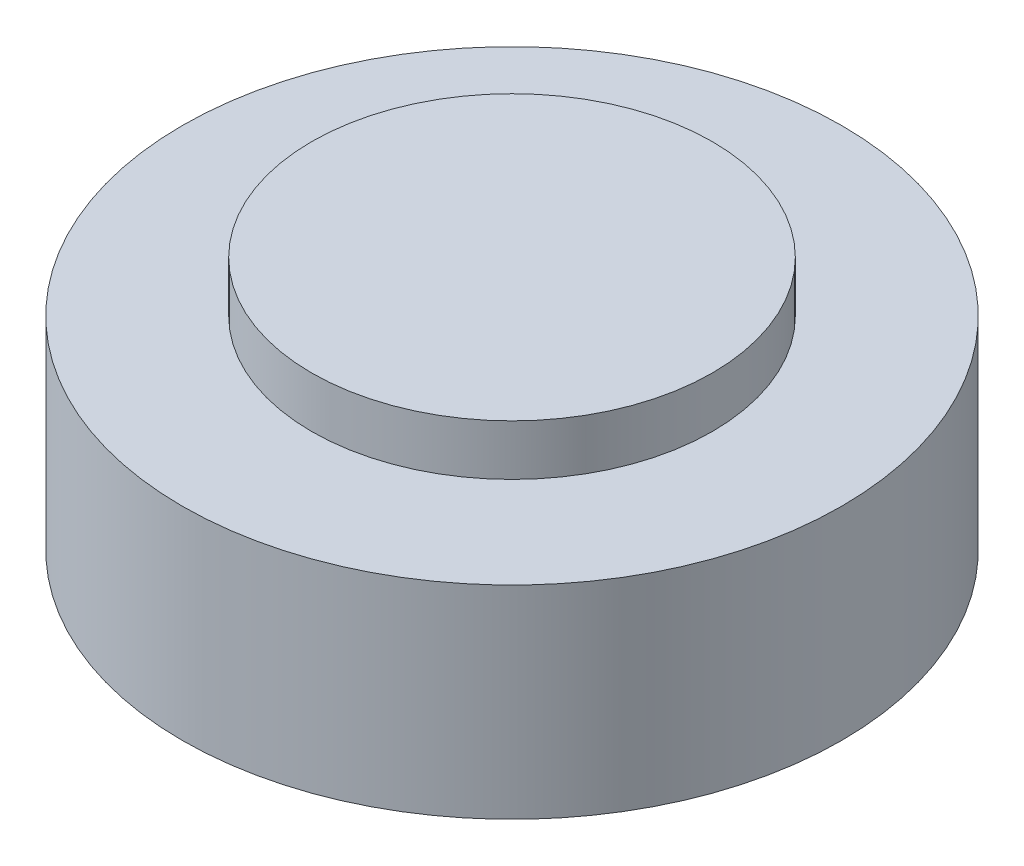
ISO-10303-21;
HEADER;
FILE_DESCRIPTION(('STEP AP214'),'2;1');
FILE_NAME('part.step','',(''),(''),'','','');
FILE_SCHEMA(('AUTOMOTIVE_DESIGN { 1 0 10303 214 1 1 1 1 }'));
ENDSEC;
DATA;
#1=APPLICATION_CONTEXT('core data for automotive mechanical design processes');
#2=APPLICATION_PROTOCOL_DEFINITION('international standard','automotive_design',2000,#1);
#3=PRODUCT_CONTEXT('',#1,'mechanical');
#4=PRODUCT('Part','Part','',(#3));
#5=PRODUCT_RELATED_PRODUCT_CATEGORY('part','',(#4));
#6=PRODUCT_DEFINITION_FORMATION('','',#4);
#7=PRODUCT_DEFINITION_CONTEXT('part definition',#1,'design');
#8=PRODUCT_DEFINITION('design','',#6,#7);
#9=PRODUCT_DEFINITION_SHAPE('','',#8);
#10=(LENGTH_UNIT() NAMED_UNIT(*) SI_UNIT(.MILLI.,.METRE.));
#11=(NAMED_UNIT(*) PLANE_ANGLE_UNIT() SI_UNIT($,.RADIAN.));
#12=(NAMED_UNIT(*) SI_UNIT($,.STERADIAN.) SOLID_ANGLE_UNIT());
#13=UNCERTAINTY_MEASURE_WITH_UNIT(LENGTH_MEASURE(1.E-05),#10,'distance_accuracy_value','');
#14=(GEOMETRIC_REPRESENTATION_CONTEXT(3) GLOBAL_UNCERTAINTY_ASSIGNED_CONTEXT((#13)) GLOBAL_UNIT_ASSIGNED_CONTEXT((#10,
#11,#12)) REPRESENTATION_CONTEXT('',''));
#15=CARTESIAN_POINT('',(0.,0.,0.));
#16=DIRECTION('',(0.,0.,1.));
#17=DIRECTION('',(1.,0.,0.));
#18=AXIS2_PLACEMENT_3D('',#15,#16,#17);
#19=CARTESIAN_POINT('',(0.,2.,0.));
#20=DIRECTION('',(0.,-1.,0.));
#21=DIRECTION('',(0.,0.,-1.));
#22=AXIS2_PLACEMENT_3D('',#19,#20,#21);
#23=CYLINDRICAL_SURFACE('',#22,7.9);
#24=CARTESIAN_POINT('',(0.,2.,0.));
#25=DIRECTION('',(0.,1.,0.));
#26=DIRECTION('',(0.,0.,1.));
#27=AXIS2_PLACEMENT_3D('',#24,#25,#26);
#28=CIRCLE('',#27,7.9);
#29=CARTESIAN_POINT('',(0.,2.,7.9));
#30=VERTEX_POINT('',#29);
#31=EDGE_CURVE('E10',#30,#30,#28,.T.);
#32=ORIENTED_EDGE('',*,*,#31,.F.);
#33=EDGE_LOOP('',(#32));
#34=FACE_BOUND('',#33,.T.);
#35=CARTESIAN_POINT('',(0.,0.,0.));
#36=DIRECTION('',(0.,1.,0.));
#37=DIRECTION('',(0.,0.,1.));
#38=AXIS2_PLACEMENT_3D('',#35,#36,#37);
#39=CIRCLE('',#38,7.9);
#40=CARTESIAN_POINT('',(0.,0.,7.9));
#41=VERTEX_POINT('',#40);
#42=EDGE_CURVE('E40',#41,#41,#39,.T.);
#43=ORIENTED_EDGE('',*,*,#42,.T.);
#44=EDGE_LOOP('',(#43));
#45=FACE_BOUND('',#44,.T.);
#46=ADVANCED_FACE('F37',(#34,#45),#23,.T.);
#47=CARTESIAN_POINT('',(0.,2.,0.));
#48=DIRECTION('',(0.,1.,0.));
#49=DIRECTION('',(0.,0.,1.));
#50=AXIS2_PLACEMENT_3D('',#47,#48,#49);
#51=PLANE('',#50);
#52=ORIENTED_EDGE('',*,*,#31,.T.);
#53=EDGE_LOOP('',(#52));
#54=FACE_BOUND('',#53,.T.);
#55=ADVANCED_FACE('F68',(#54),#51,.T.);
#56=CARTESIAN_POINT('',(0.,-8.,0.));
#57=DIRECTION('',(0.,1.,0.));
#58=DIRECTION('',(0.,0.,1.));
#59=AXIS2_PLACEMENT_3D('',#56,#57,#58);
#60=CYLINDRICAL_SURFACE('',#59,13.);
#61=CARTESIAN_POINT('',(0.,-8.,0.));
#62=DIRECTION('',(0.,1.,0.));
#63=DIRECTION('',(0.,0.,1.));
#64=AXIS2_PLACEMENT_3D('',#61,#62,#63);
#65=CIRCLE('',#64,13.);
#66=CARTESIAN_POINT('',(0.,-8.,13.));
#67=VERTEX_POINT('',#66);
#68=EDGE_CURVE('E47',#67,#67,#65,.T.);
#69=ORIENTED_EDGE('',*,*,#68,.T.);
#70=EDGE_LOOP('',(#69));
#71=FACE_BOUND('',#70,.T.);
#72=CARTESIAN_POINT('',(0.,0.,0.));
#73=DIRECTION('',(0.,1.,0.));
#74=DIRECTION('',(0.,0.,1.));
#75=AXIS2_PLACEMENT_3D('',#72,#73,#74);
#76=CIRCLE('',#75,13.);
#77=CARTESIAN_POINT('',(0.,0.,13.));
#78=VERTEX_POINT('',#77);
#79=EDGE_CURVE('E49',#78,#78,#76,.T.);
#80=ORIENTED_EDGE('',*,*,#79,.F.);
#81=EDGE_LOOP('',(#80));
#82=FACE_BOUND('',#81,.T.);
#83=ADVANCED_FACE('F55',(#71,#82),#60,.T.);
#84=CARTESIAN_POINT('',(0.,-8.,0.));
#85=DIRECTION('',(0.,1.,0.));
#86=DIRECTION('',(0.,0.,1.));
#87=AXIS2_PLACEMENT_3D('',#84,#85,#86);
#88=PLANE('',#87);
#89=ORIENTED_EDGE('',*,*,#68,.F.);
#90=EDGE_LOOP('',(#89));
#91=FACE_BOUND('',#90,.T.);
#92=ADVANCED_FACE('F58',(#91),#88,.F.);
#93=CARTESIAN_POINT('',(0.,0.,0.));
#94=DIRECTION('',(0.,1.,0.));
#95=DIRECTION('',(0.,0.,1.));
#96=AXIS2_PLACEMENT_3D('',#93,#94,#95);
#97=PLANE('',#96);
#98=ORIENTED_EDGE('',*,*,#42,.F.);
#99=EDGE_LOOP('',(#98));
#100=FACE_BOUND('',#99,.T.);
#101=ORIENTED_EDGE('',*,*,#79,.T.);
#102=EDGE_LOOP('',(#101));
#103=FACE_BOUND('',#102,.T.);
#104=ADVANCED_FACE('F60',(#100,#103),#97,.T.);
#105=CLOSED_SHELL('',(#46,#55,#83,#92,#104));
#106=MANIFOLD_SOLID_BREP('B2',#105);
#107=ADVANCED_BREP_SHAPE_REPRESENTATION('',(#18,#106),#14);
#108=SHAPE_DEFINITION_REPRESENTATION(#9,#107);
ENDSEC;
END-ISO-10303-21;
